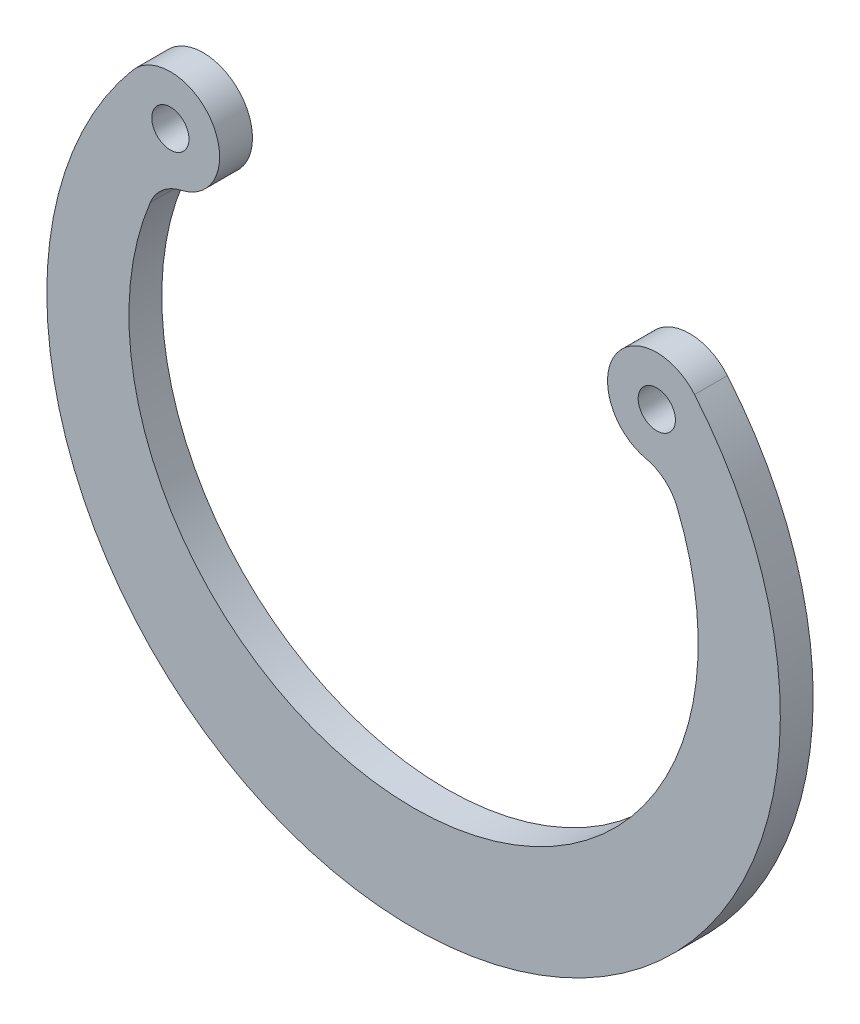
ISO-10303-21;
HEADER;
FILE_DESCRIPTION(('STEP AP214'),'2;1');
FILE_NAME('part.step','',(''),(''),'','','');
FILE_SCHEMA(('AUTOMOTIVE_DESIGN { 1 0 10303 214 1 1 1 1 }'));
ENDSEC;
DATA;
#1=APPLICATION_CONTEXT('core data for automotive mechanical design processes');
#2=APPLICATION_PROTOCOL_DEFINITION('international standard','automotive_design',2000,#1);
#3=PRODUCT_CONTEXT('',#1,'mechanical');
#4=PRODUCT('Part','Part','',(#3));
#5=PRODUCT_RELATED_PRODUCT_CATEGORY('part','',(#4));
#6=PRODUCT_DEFINITION_FORMATION('','',#4);
#7=PRODUCT_DEFINITION_CONTEXT('part definition',#1,'design');
#8=PRODUCT_DEFINITION('design','',#6,#7);
#9=PRODUCT_DEFINITION_SHAPE('','',#8);
#10=(LENGTH_UNIT() NAMED_UNIT(*) SI_UNIT(.MILLI.,.METRE.));
#11=(NAMED_UNIT(*) PLANE_ANGLE_UNIT() SI_UNIT($,.RADIAN.));
#12=(NAMED_UNIT(*) SI_UNIT($,.STERADIAN.) SOLID_ANGLE_UNIT());
#13=UNCERTAINTY_MEASURE_WITH_UNIT(LENGTH_MEASURE(1.E-05),#10,'distance_accuracy_value','');
#14=(GEOMETRIC_REPRESENTATION_CONTEXT(3) GLOBAL_UNCERTAINTY_ASSIGNED_CONTEXT((#13)) GLOBAL_UNIT_ASSIGNED_CONTEXT((#10,
#11,#12)) REPRESENTATION_CONTEXT('',''));
#15=CARTESIAN_POINT('',(0.,0.,0.));
#16=DIRECTION('',(0.,0.,1.));
#17=DIRECTION('',(1.,0.,0.));
#18=AXIS2_PLACEMENT_3D('',#15,#16,#17);
#19=CARTESIAN_POINT('',(-10.177542038219,5.17344438806672,-1.5));
#20=DIRECTION('',(0.,0.,1.));
#21=DIRECTION('',(1.,0.,0.));
#22=AXIS2_PLACEMENT_3D('',#19,#20,#21);
#23=CYLINDRICAL_SURFACE('',#22,2.);
#24=CARTESIAN_POINT('',(-10.177542038219,5.17344438806672,0.));
#25=DIRECTION('',(0.,0.,1.));
#26=DIRECTION('',(1.,0.,0.));
#27=AXIS2_PLACEMENT_3D('',#24,#25,#26);
#28=CIRCLE('',#27,2.);
#29=CARTESIAN_POINT('',(-12.0280042269861,5.9322524586243,0.));
#30=VERTEX_POINT('',#29);
#31=CARTESIAN_POINT('',(-10.6152372791631,7.12496248330819,0.));
#32=VERTEX_POINT('',#31);
#33=EDGE_CURVE('E129',#30,#32,#28,.F.);
#34=ORIENTED_EDGE('',*,*,#33,.F.);
#35=DIRECTION('',(0.,0.,1.));
#36=VECTOR('',#35,1.);
#37=CARTESIAN_POINT('',(-12.0280042269861,5.9322524586243,-1.5));
#38=LINE('',#37,#36);
#39=CARTESIAN_POINT('',(-12.0280042269861,5.9322524586243,-1.5));
#40=VERTEX_POINT('',#39);
#41=EDGE_CURVE('E11',#40,#30,#38,.T.);
#42=ORIENTED_EDGE('',*,*,#41,.F.);
#43=CARTESIAN_POINT('',(-10.177542038219,5.17344438806672,-1.5));
#44=DIRECTION('',(0.,0.,1.));
#45=DIRECTION('',(1.,0.,0.));
#46=AXIS2_PLACEMENT_3D('',#43,#44,#45);
#47=CIRCLE('',#46,2.);
#48=CARTESIAN_POINT('',(-10.6152372791631,7.12496248330819,-1.5));
#49=VERTEX_POINT('',#48);
#50=EDGE_CURVE('E151',#40,#49,#47,.F.);
#51=ORIENTED_EDGE('',*,*,#50,.T.);
#52=DIRECTION('',(0.,0.,1.));
#53=VECTOR('',#52,1.);
#54=CARTESIAN_POINT('',(-10.6152372791631,7.12496248330819,-1.5));
#55=LINE('',#54,#53);
#56=EDGE_CURVE('E40',#49,#32,#55,.T.);
#57=ORIENTED_EDGE('',*,*,#56,.T.);
#58=EDGE_LOOP('',(#34,#42,#51,#57));
#59=FACE_BOUND('',#58,.T.);
#60=ADVANCED_FACE('F36',(#59),#23,.F.);
#61=CARTESIAN_POINT('',(0.,1.,-1.5));
#62=DIRECTION('',(0.,0.,1.));
#63=DIRECTION('',(1.,0.,0.));
#64=AXIS2_PLACEMENT_3D('',#61,#62,#63);
#65=CYLINDRICAL_SURFACE('',#64,13.);
#66=CARTESIAN_POINT('',(0.,1.,0.));
#67=DIRECTION('',(0.,0.,1.));
#68=DIRECTION('',(1.,0.,0.));
#69=AXIS2_PLACEMENT_3D('',#66,#67,#68);
#70=CIRCLE('',#69,13.);
#71=CARTESIAN_POINT('',(12.0280042269861,5.9322524586243,0.));
#72=VERTEX_POINT('',#71);
#73=EDGE_CURVE('E141',#72,#30,#70,.F.);
#74=ORIENTED_EDGE('',*,*,#73,.F.);
#75=DIRECTION('',(0.,0.,1.));
#76=VECTOR('',#75,1.);
#77=CARTESIAN_POINT('',(12.0280042269861,5.9322524586243,-1.5));
#78=LINE('',#77,#76);
#79=CARTESIAN_POINT('',(12.0280042269861,5.9322524586243,-1.5));
#80=VERTEX_POINT('',#79);
#81=EDGE_CURVE('E46',#80,#72,#78,.T.);
#82=ORIENTED_EDGE('',*,*,#81,.F.);
#83=CARTESIAN_POINT('',(0.,1.,-1.5));
#84=DIRECTION('',(0.,0.,1.));
#85=DIRECTION('',(1.,0.,0.));
#86=AXIS2_PLACEMENT_3D('',#83,#84,#85);
#87=CIRCLE('',#86,13.);
#88=EDGE_CURVE('E113',#80,#40,#87,.F.);
#89=ORIENTED_EDGE('',*,*,#88,.T.);
#90=ORIENTED_EDGE('',*,*,#41,.T.);
#91=EDGE_LOOP('',(#74,#82,#89,#90));
#92=FACE_BOUND('',#91,.T.);
#93=ADVANCED_FACE('F156',(#92),#65,.F.);
#94=CARTESIAN_POINT('',(10.177542038219,5.17344438806672,-1.5));
#95=DIRECTION('',(0.,0.,1.));
#96=DIRECTION('',(1.,0.,0.));
#97=AXIS2_PLACEMENT_3D('',#94,#95,#96);
#98=CYLINDRICAL_SURFACE('',#97,2.);
#99=CARTESIAN_POINT('',(10.177542038219,5.17344438806672,0.));
#100=DIRECTION('',(0.,0.,1.));
#101=DIRECTION('',(1.,0.,0.));
#102=AXIS2_PLACEMENT_3D('',#99,#100,#101);
#103=CIRCLE('',#102,2.);
#104=CARTESIAN_POINT('',(10.6152372791631,7.12496248330819,0.));
#105=VERTEX_POINT('',#104);
#106=EDGE_CURVE('E99',#105,#72,#103,.F.);
#107=ORIENTED_EDGE('',*,*,#106,.F.);
#108=DIRECTION('',(0.,0.,1.));
#109=VECTOR('',#108,1.);
#110=CARTESIAN_POINT('',(10.6152372791631,7.12496248330819,-1.5));
#111=LINE('',#110,#109);
#112=CARTESIAN_POINT('',(10.6152372791631,7.12496248330819,-1.5));
#113=VERTEX_POINT('',#112);
#114=EDGE_CURVE('E94',#113,#105,#111,.T.);
#115=ORIENTED_EDGE('',*,*,#114,.F.);
#116=CARTESIAN_POINT('',(10.177542038219,5.17344438806672,-1.5));
#117=DIRECTION('',(0.,0.,1.));
#118=DIRECTION('',(1.,0.,0.));
#119=AXIS2_PLACEMENT_3D('',#116,#117,#118);
#120=CIRCLE('',#119,2.);
#121=EDGE_CURVE('E97',#113,#80,#120,.F.);
#122=ORIENTED_EDGE('',*,*,#121,.T.);
#123=ORIENTED_EDGE('',*,*,#81,.T.);
#124=EDGE_LOOP('',(#107,#115,#122,#123));
#125=FACE_BOUND('',#124,.T.);
#126=ADVANCED_FACE('F96',(#125),#98,.F.);
#127=CARTESIAN_POINT('',(11.1076444252252,9.32042034045485,-1.5));
#128=DIRECTION('',(0.,0.,1.));
#129=DIRECTION('',(1.,0.,0.));
#130=AXIS2_PLACEMENT_3D('',#127,#128,#129);
#131=CYLINDRICAL_SURFACE('',#130,2.25);
#132=CARTESIAN_POINT('',(11.1076444252252,9.32042034045485,0.));
#133=DIRECTION('',(0.,0.,1.));
#134=DIRECTION('',(1.,0.,0.));
#135=AXIS2_PLACEMENT_3D('',#132,#133,#134);
#136=CIRCLE('',#135,2.25);
#137=CARTESIAN_POINT('',(12.8312444222429,10.7666924622496,0.));
#138=VERTEX_POINT('',#137);
#139=EDGE_CURVE('E138',#138,#105,#136,.T.);
#140=ORIENTED_EDGE('',*,*,#139,.F.);
#141=DIRECTION('',(0.,0.,1.));
#142=VECTOR('',#141,1.);
#143=CARTESIAN_POINT('',(12.8312444222429,10.7666924622496,-1.5));
#144=LINE('',#143,#142);
#145=CARTESIAN_POINT('',(12.8312444222429,10.7666924622496,-1.5));
#146=VERTEX_POINT('',#145);
#147=EDGE_CURVE('E104',#146,#138,#144,.T.);
#148=ORIENTED_EDGE('',*,*,#147,.F.);
#149=CARTESIAN_POINT('',(11.1076444252252,9.32042034045485,-1.5));
#150=DIRECTION('',(0.,0.,1.));
#151=DIRECTION('',(1.,0.,0.));
#152=AXIS2_PLACEMENT_3D('',#149,#150,#151);
#153=CIRCLE('',#152,2.25);
#154=EDGE_CURVE('E111',#146,#113,#153,.T.);
#155=ORIENTED_EDGE('',*,*,#154,.T.);
#156=ORIENTED_EDGE('',*,*,#114,.T.);
#157=EDGE_LOOP('',(#140,#148,#155,#156));
#158=FACE_BOUND('',#157,.T.);
#159=ADVANCED_FACE('F115',(#158),#131,.T.);
#160=CARTESIAN_POINT('',(0.,0.,-1.5));
#161=DIRECTION('',(0.,0.,1.));
#162=DIRECTION('',(1.,0.,0.));
#163=AXIS2_PLACEMENT_3D('',#160,#161,#162);
#164=CYLINDRICAL_SURFACE('',#163,16.75);
#165=CARTESIAN_POINT('',(0.,0.,0.));
#166=DIRECTION('',(0.,0.,1.));
#167=DIRECTION('',(1.,0.,0.));
#168=AXIS2_PLACEMENT_3D('',#165,#166,#167);
#169=CIRCLE('',#168,16.75);
#170=CARTESIAN_POINT('',(-12.8312444222429,10.7666924622496,0.));
#171=VERTEX_POINT('',#170);
#172=EDGE_CURVE('E135',#171,#138,#169,.T.);
#173=ORIENTED_EDGE('',*,*,#172,.F.);
#174=DIRECTION('',(0.,0.,1.));
#175=VECTOR('',#174,1.);
#176=CARTESIAN_POINT('',(-12.8312444222429,10.7666924622496,-1.5));
#177=LINE('',#176,#175);
#178=CARTESIAN_POINT('',(-12.8312444222429,10.7666924622496,-1.5));
#179=VERTEX_POINT('',#178);
#180=EDGE_CURVE('E149',#179,#171,#177,.T.);
#181=ORIENTED_EDGE('',*,*,#180,.F.);
#182=CARTESIAN_POINT('',(0.,0.,-1.5));
#183=DIRECTION('',(0.,0.,1.));
#184=DIRECTION('',(1.,0.,0.));
#185=AXIS2_PLACEMENT_3D('',#182,#183,#184);
#186=CIRCLE('',#185,16.75);
#187=EDGE_CURVE('E116',#179,#146,#186,.T.);
#188=ORIENTED_EDGE('',*,*,#187,.T.);
#189=ORIENTED_EDGE('',*,*,#147,.T.);
#190=EDGE_LOOP('',(#173,#181,#188,#189));
#191=FACE_BOUND('',#190,.T.);
#192=ADVANCED_FACE('F170',(#191),#164,.T.);
#193=CARTESIAN_POINT('',(-11.1076444252252,9.32042034045485,-1.5));
#194=DIRECTION('',(0.,0.,1.));
#195=DIRECTION('',(1.,0.,0.));
#196=AXIS2_PLACEMENT_3D('',#193,#194,#195);
#197=CYLINDRICAL_SURFACE('',#196,2.25);
#198=CARTESIAN_POINT('',(-11.1076444252252,9.32042034045485,0.));
#199=DIRECTION('',(0.,0.,1.));
#200=DIRECTION('',(1.,0.,0.));
#201=AXIS2_PLACEMENT_3D('',#198,#199,#200);
#202=CIRCLE('',#201,2.25);
#203=EDGE_CURVE('E132',#32,#171,#202,.T.);
#204=ORIENTED_EDGE('',*,*,#203,.F.);
#205=ORIENTED_EDGE('',*,*,#56,.F.);
#206=CARTESIAN_POINT('',(-11.1076444252252,9.32042034045485,-1.5));
#207=DIRECTION('',(0.,0.,1.));
#208=DIRECTION('',(1.,0.,0.));
#209=AXIS2_PLACEMENT_3D('',#206,#207,#208);
#210=CIRCLE('',#209,2.25);
#211=EDGE_CURVE('E118',#49,#179,#210,.T.);
#212=ORIENTED_EDGE('',*,*,#211,.T.);
#213=ORIENTED_EDGE('',*,*,#180,.T.);
#214=EDGE_LOOP('',(#204,#205,#212,#213));
#215=FACE_BOUND('',#214,.T.);
#216=ADVANCED_FACE('F152',(#215),#197,.T.);
#217=CARTESIAN_POINT('',(-11.1076444252252,9.32042034045485,-1.5));
#218=DIRECTION('',(0.,0.,1.));
#219=DIRECTION('',(1.,0.,0.));
#220=AXIS2_PLACEMENT_3D('',#217,#218,#219);
#221=CYLINDRICAL_SURFACE('',#220,0.85);
#222=CARTESIAN_POINT('',(-11.1076444252252,9.32042034045485,-1.5));
#223=DIRECTION('',(0.,0.,1.));
#224=DIRECTION('',(1.,0.,0.));
#225=AXIS2_PLACEMENT_3D('',#222,#223,#224);
#226=CIRCLE('',#225,0.85);
#227=CARTESIAN_POINT('',(-10.2576444252252,9.32042034045485,-1.5));
#228=VERTEX_POINT('',#227);
#229=EDGE_CURVE('E146',#228,#228,#226,.F.);
#230=ORIENTED_EDGE('',*,*,#229,.T.);
#231=EDGE_LOOP('',(#230));
#232=FACE_BOUND('',#231,.T.);
#233=CARTESIAN_POINT('',(-11.1076444252252,9.32042034045485,0.));
#234=DIRECTION('',(0.,0.,1.));
#235=DIRECTION('',(1.,0.,0.));
#236=AXIS2_PLACEMENT_3D('',#233,#234,#235);
#237=CIRCLE('',#236,0.85);
#238=CARTESIAN_POINT('',(-10.2576444252252,9.32042034045485,0.));
#239=VERTEX_POINT('',#238);
#240=EDGE_CURVE('E126',#239,#239,#237,.F.);
#241=ORIENTED_EDGE('',*,*,#240,.F.);
#242=EDGE_LOOP('',(#241));
#243=FACE_BOUND('',#242,.T.);
#244=ADVANCED_FACE('F38',(#232,#243),#221,.F.);
#245=CARTESIAN_POINT('',(11.1076444252252,9.32042034045485,-1.5));
#246=DIRECTION('',(0.,0.,1.));
#247=DIRECTION('',(1.,0.,0.));
#248=AXIS2_PLACEMENT_3D('',#245,#246,#247);
#249=CYLINDRICAL_SURFACE('',#248,0.85);
#250=CARTESIAN_POINT('',(11.1076444252252,9.32042034045485,-1.5));
#251=DIRECTION('',(0.,0.,1.));
#252=DIRECTION('',(1.,0.,0.));
#253=AXIS2_PLACEMENT_3D('',#250,#251,#252);
#254=CIRCLE('',#253,0.85);
#255=CARTESIAN_POINT('',(11.9576444252252,9.32042034045485,-1.5));
#256=VERTEX_POINT('',#255);
#257=EDGE_CURVE('E123',#256,#256,#254,.F.);
#258=ORIENTED_EDGE('',*,*,#257,.T.);
#259=EDGE_LOOP('',(#258));
#260=FACE_BOUND('',#259,.T.);
#261=CARTESIAN_POINT('',(11.1076444252252,9.32042034045485,0.));
#262=DIRECTION('',(0.,0.,1.));
#263=DIRECTION('',(1.,0.,0.));
#264=AXIS2_PLACEMENT_3D('',#261,#262,#263);
#265=CIRCLE('',#264,0.85);
#266=CARTESIAN_POINT('',(11.9576444252252,9.32042034045485,0.));
#267=VERTEX_POINT('',#266);
#268=EDGE_CURVE('E144',#267,#267,#265,.F.);
#269=ORIENTED_EDGE('',*,*,#268,.F.);
#270=EDGE_LOOP('',(#269));
#271=FACE_BOUND('',#270,.T.);
#272=ADVANCED_FACE('F165',(#260,#271),#249,.F.);
#273=CARTESIAN_POINT('',(0.,0.,-1.5));
#274=DIRECTION('',(0.,0.,1.));
#275=DIRECTION('',(1.,0.,0.));
#276=AXIS2_PLACEMENT_3D('',#273,#274,#275);
#277=PLANE('',#276);
#278=ORIENTED_EDGE('',*,*,#229,.F.);
#279=EDGE_LOOP('',(#278));
#280=FACE_BOUND('',#279,.T.);
#281=ORIENTED_EDGE('',*,*,#50,.F.);
#282=ORIENTED_EDGE('',*,*,#88,.F.);
#283=ORIENTED_EDGE('',*,*,#121,.F.);
#284=ORIENTED_EDGE('',*,*,#154,.F.);
#285=ORIENTED_EDGE('',*,*,#187,.F.);
#286=ORIENTED_EDGE('',*,*,#211,.F.);
#287=EDGE_LOOP('',(#281,#282,#283,#284,#285,#286));
#288=FACE_BOUND('',#287,.T.);
#289=ORIENTED_EDGE('',*,*,#257,.F.);
#290=EDGE_LOOP('',(#289));
#291=FACE_BOUND('',#290,.T.);
#292=ADVANCED_FACE('F108',(#280,#288,#291),#277,.F.);
#293=CARTESIAN_POINT('',(0.,0.,0.));
#294=DIRECTION('',(0.,0.,1.));
#295=DIRECTION('',(1.,0.,0.));
#296=AXIS2_PLACEMENT_3D('',#293,#294,#295);
#297=PLANE('',#296);
#298=ORIENTED_EDGE('',*,*,#240,.T.);
#299=EDGE_LOOP('',(#298));
#300=FACE_BOUND('',#299,.T.);
#301=ORIENTED_EDGE('',*,*,#33,.T.);
#302=ORIENTED_EDGE('',*,*,#203,.T.);
#303=ORIENTED_EDGE('',*,*,#172,.T.);
#304=ORIENTED_EDGE('',*,*,#139,.T.);
#305=ORIENTED_EDGE('',*,*,#106,.T.);
#306=ORIENTED_EDGE('',*,*,#73,.T.);
#307=EDGE_LOOP('',(#301,#302,#303,#304,#305,#306));
#308=FACE_BOUND('',#307,.T.);
#309=ORIENTED_EDGE('',*,*,#268,.T.);
#310=EDGE_LOOP('',(#309));
#311=FACE_BOUND('',#310,.T.);
#312=ADVANCED_FACE('F154',(#300,#308,#311),#297,.T.);
#313=CLOSED_SHELL('',(#60,#93,#126,#159,#192,#216,#244,#272,#292,#312));
#314=MANIFOLD_SOLID_BREP('B2',#313);
#315=ADVANCED_BREP_SHAPE_REPRESENTATION('',(#18,#314),#14);
#316=SHAPE_DEFINITION_REPRESENTATION(#9,#315);
ENDSEC;
END-ISO-10303-21;
